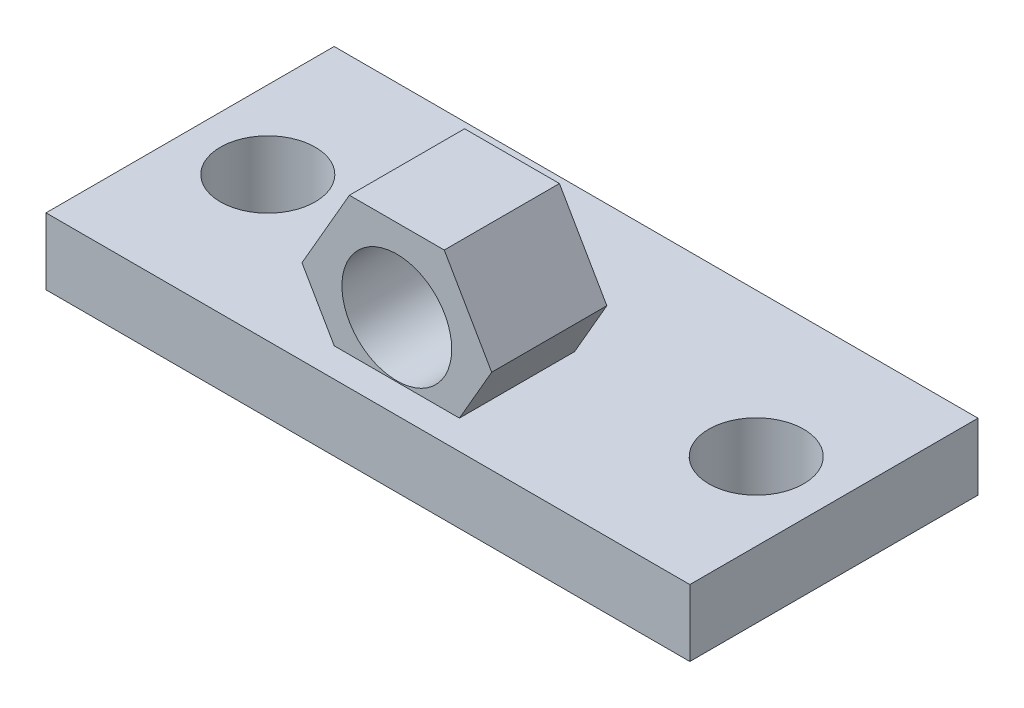
ISO-10303-21;
HEADER;
FILE_DESCRIPTION(('STEP AP214'),'2;1');
FILE_NAME('part.step','',(''),(''),'','','');
FILE_SCHEMA(('AUTOMOTIVE_DESIGN { 1 0 10303 214 1 1 1 1 }'));
ENDSEC;
DATA;
#1=APPLICATION_CONTEXT('core data for automotive mechanical design processes');
#2=APPLICATION_PROTOCOL_DEFINITION('international standard','automotive_design',2000,#1);
#3=PRODUCT_CONTEXT('',#1,'mechanical');
#4=PRODUCT('Part','Part','',(#3));
#5=PRODUCT_RELATED_PRODUCT_CATEGORY('part','',(#4));
#6=PRODUCT_DEFINITION_FORMATION('','',#4);
#7=PRODUCT_DEFINITION_CONTEXT('part definition',#1,'design');
#8=PRODUCT_DEFINITION('design','',#6,#7);
#9=PRODUCT_DEFINITION_SHAPE('','',#8);
#10=(LENGTH_UNIT() NAMED_UNIT(*) SI_UNIT(.MILLI.,.METRE.));
#11=(NAMED_UNIT(*) PLANE_ANGLE_UNIT() SI_UNIT($,.RADIAN.));
#12=(NAMED_UNIT(*) SI_UNIT($,.STERADIAN.) SOLID_ANGLE_UNIT());
#13=UNCERTAINTY_MEASURE_WITH_UNIT(LENGTH_MEASURE(1.E-05),#10,'distance_accuracy_value','');
#14=(GEOMETRIC_REPRESENTATION_CONTEXT(3) GLOBAL_UNCERTAINTY_ASSIGNED_CONTEXT((#13)) GLOBAL_UNIT_ASSIGNED_CONTEXT((#10,
#11,#12)) REPRESENTATION_CONTEXT('',''));
#15=CARTESIAN_POINT('',(0.,0.,0.));
#16=DIRECTION('',(0.,0.,1.));
#17=DIRECTION('',(1.,0.,0.));
#18=AXIS2_PLACEMENT_3D('',#15,#16,#17);
#19=CARTESIAN_POINT('',(0.,5.,0.));
#20=DIRECTION('',(0.,1.,0.));
#21=DIRECTION('',(0.,0.,1.));
#22=AXIS2_PLACEMENT_3D('',#19,#20,#21);
#23=PLANE('',#22);
#24=DIRECTION('',(0.,0.,-1.));
#25=VECTOR('',#24,1.);
#26=CARTESIAN_POINT('',(24.1402131088825,5.,-10.804011461318));
#27=LINE('',#26,#25);
#28=CARTESIAN_POINT('',(24.1402131088825,5.,10.804011461318));
#29=VERTEX_POINT('',#28);
#30=CARTESIAN_POINT('',(24.1402131088825,5.,-10.804011461318));
#31=VERTEX_POINT('',#30);
#32=EDGE_CURVE('E160',#29,#31,#27,.T.);
#33=ORIENTED_EDGE('',*,*,#32,.T.);
#34=DIRECTION('',(-1.,0.,0.));
#35=VECTOR('',#34,1.);
#36=CARTESIAN_POINT('',(-24.1402131088825,5.,-10.804011461318));
#37=LINE('',#36,#35);
#38=CARTESIAN_POINT('',(-24.1402131088825,5.,-10.804011461318));
#39=VERTEX_POINT('',#38);
#40=EDGE_CURVE('E86',#31,#39,#37,.T.);
#41=ORIENTED_EDGE('',*,*,#40,.T.);
#42=DIRECTION('',(0.,0.,1.));
#43=VECTOR('',#42,1.);
#44=CARTESIAN_POINT('',(-24.1402131088825,5.,-10.804011461318));
#45=LINE('',#44,#43);
#46=CARTESIAN_POINT('',(-24.1402131088825,5.,10.804011461318));
#47=VERTEX_POINT('',#46);
#48=EDGE_CURVE('E163',#39,#47,#45,.T.);
#49=ORIENTED_EDGE('',*,*,#48,.T.);
#50=DIRECTION('',(1.,0.,0.));
#51=VECTOR('',#50,1.);
#52=CARTESIAN_POINT('',(-24.1402131088825,5.,10.804011461318));
#53=LINE('',#52,#51);
#54=EDGE_CURVE('E57',#47,#29,#53,.T.);
#55=ORIENTED_EDGE('',*,*,#54,.T.);
#56=EDGE_LOOP('',(#33,#41,#49,#55));
#57=FACE_BOUND('',#56,.T.);
#58=CARTESIAN_POINT('',(18.3128397154953,5.,0.));
#59=DIRECTION('',(0.,1.,0.));
#60=DIRECTION('',(0.,0.,1.));
#61=AXIS2_PLACEMENT_3D('',#58,#59,#60);
#62=CIRCLE('',#61,3.556);
#63=CARTESIAN_POINT('',(18.3128397154953,5.,3.556));
#64=VERTEX_POINT('',#63);
#65=EDGE_CURVE('E156',#64,#64,#62,.T.);
#66=ORIENTED_EDGE('',*,*,#65,.F.);
#67=EDGE_LOOP('',(#66));
#68=FACE_BOUND('',#67,.T.);
#69=CARTESIAN_POINT('',(-18.3128397154953,5.,0.));
#70=DIRECTION('',(0.,1.,0.));
#71=DIRECTION('',(0.,0.,1.));
#72=AXIS2_PLACEMENT_3D('',#69,#70,#71);
#73=CIRCLE('',#72,3.556);
#74=CARTESIAN_POINT('',(-18.3128397154953,5.,3.556));
#75=VERTEX_POINT('',#74);
#76=EDGE_CURVE('E147',#75,#75,#73,.T.);
#77=ORIENTED_EDGE('',*,*,#76,.F.);
#78=EDGE_LOOP('',(#77));
#79=FACE_BOUND('',#78,.T.);
#80=DIRECTION('',(1.,0.,0.));
#81=VECTOR('',#80,1.);
#82=CARTESIAN_POINT('',(0.,5.,0.));
#83=LINE('',#82,#81);
#84=CARTESIAN_POINT('',(-4.69311753214681,5.,0.));
#85=VERTEX_POINT('',#84);
#86=CARTESIAN_POINT('',(4.69311753214686,5.,0.));
#87=VERTEX_POINT('',#86);
#88=EDGE_CURVE('E187',#85,#87,#83,.T.);
#89=ORIENTED_EDGE('',*,*,#88,.T.);
#90=DIRECTION('',(0.,0.,1.));
#91=VECTOR('',#90,1.);
#92=CARTESIAN_POINT('',(4.69311753214686,5.,0.));
#93=LINE('',#92,#91);
#94=CARTESIAN_POINT('',(4.69311753214686,5.,8.63600000000001));
#95=VERTEX_POINT('',#94);
#96=EDGE_CURVE('E11',#87,#95,#93,.T.);
#97=ORIENTED_EDGE('',*,*,#96,.T.);
#98=DIRECTION('',(1.,0.,0.));
#99=VECTOR('',#98,1.);
#100=CARTESIAN_POINT('',(0.,5.,8.63600000000001));
#101=LINE('',#100,#99);
#102=CARTESIAN_POINT('',(-4.69311753214681,5.,8.63600000000001));
#103=VERTEX_POINT('',#102);
#104=EDGE_CURVE('E41',#103,#95,#101,.T.);
#105=ORIENTED_EDGE('',*,*,#104,.F.);
#106=DIRECTION('',(0.,0.,-1.));
#107=VECTOR('',#106,1.);
#108=CARTESIAN_POINT('',(-4.69311753214681,5.,0.));
#109=LINE('',#108,#107);
#110=EDGE_CURVE('E182',#103,#85,#109,.T.);
#111=ORIENTED_EDGE('',*,*,#110,.T.);
#112=EDGE_LOOP('',(#89,#97,#105,#111));
#113=FACE_BOUND('',#112,.T.);
#114=ADVANCED_FACE('F33',(#57,#68,#79,#113),#23,.T.);
#115=CARTESIAN_POINT('',(0.,0.,0.));
#116=DIRECTION('',(0.,1.,0.));
#117=DIRECTION('',(0.,0.,1.));
#118=AXIS2_PLACEMENT_3D('',#115,#116,#117);
#119=PLANE('',#118);
#120=CARTESIAN_POINT('',(-18.3128397154953,0.,0.));
#121=DIRECTION('',(0.,1.,0.));
#122=DIRECTION('',(0.,0.,1.));
#123=AXIS2_PLACEMENT_3D('',#120,#121,#122);
#124=CIRCLE('',#123,3.556);
#125=CARTESIAN_POINT('',(-18.3128397154953,0.,3.556));
#126=VERTEX_POINT('',#125);
#127=EDGE_CURVE('E144',#126,#126,#124,.T.);
#128=ORIENTED_EDGE('',*,*,#127,.T.);
#129=EDGE_LOOP('',(#128));
#130=FACE_BOUND('',#129,.T.);
#131=CARTESIAN_POINT('',(18.3128397154953,0.,0.));
#132=DIRECTION('',(0.,1.,0.));
#133=DIRECTION('',(0.,0.,1.));
#134=AXIS2_PLACEMENT_3D('',#131,#132,#133);
#135=CIRCLE('',#134,3.556);
#136=CARTESIAN_POINT('',(18.3128397154953,0.,3.556));
#137=VERTEX_POINT('',#136);
#138=EDGE_CURVE('E155',#137,#137,#135,.T.);
#139=ORIENTED_EDGE('',*,*,#138,.T.);
#140=EDGE_LOOP('',(#139));
#141=FACE_BOUND('',#140,.T.);
#142=DIRECTION('',(0.,0.,-1.));
#143=VECTOR('',#142,1.);
#144=CARTESIAN_POINT('',(24.1402131088825,0.,-10.804011461318));
#145=LINE('',#144,#143);
#146=CARTESIAN_POINT('',(24.1402131088825,0.,10.804011461318));
#147=VERTEX_POINT('',#146);
#148=CARTESIAN_POINT('',(24.1402131088825,0.,-10.804011461318));
#149=VERTEX_POINT('',#148);
#150=EDGE_CURVE('E159',#147,#149,#145,.T.);
#151=ORIENTED_EDGE('',*,*,#150,.F.);
#152=DIRECTION('',(1.,0.,0.));
#153=VECTOR('',#152,1.);
#154=CARTESIAN_POINT('',(-24.1402131088825,0.,10.804011461318));
#155=LINE('',#154,#153);
#156=CARTESIAN_POINT('',(-24.1402131088825,0.,10.804011461318));
#157=VERTEX_POINT('',#156);
#158=EDGE_CURVE('E78',#157,#147,#155,.T.);
#159=ORIENTED_EDGE('',*,*,#158,.F.);
#160=DIRECTION('',(0.,0.,1.));
#161=VECTOR('',#160,1.);
#162=CARTESIAN_POINT('',(-24.1402131088825,0.,-10.804011461318));
#163=LINE('',#162,#161);
#164=CARTESIAN_POINT('',(-24.1402131088825,0.,-10.804011461318));
#165=VERTEX_POINT('',#164);
#166=EDGE_CURVE('E171',#165,#157,#163,.T.);
#167=ORIENTED_EDGE('',*,*,#166,.F.);
#168=DIRECTION('',(-1.,0.,0.));
#169=VECTOR('',#168,1.);
#170=CARTESIAN_POINT('',(-24.1402131088825,0.,-10.804011461318));
#171=LINE('',#170,#169);
#172=EDGE_CURVE('E169',#149,#165,#171,.T.);
#173=ORIENTED_EDGE('',*,*,#172,.F.);
#174=EDGE_LOOP('',(#151,#159,#167,#173));
#175=FACE_BOUND('',#174,.T.);
#176=ADVANCED_FACE('F237',(#130,#141,#175),#119,.F.);
#177=CARTESIAN_POINT('',(24.1402131088825,5.,-10.804011461318));
#178=DIRECTION('',(-1.,0.,0.));
#179=DIRECTION('',(0.,0.,1.));
#180=AXIS2_PLACEMENT_3D('',#177,#178,#179);
#181=PLANE('',#180);
#182=ORIENTED_EDGE('',*,*,#150,.T.);
#183=DIRECTION('',(0.,-1.,0.));
#184=VECTOR('',#183,1.);
#185=CARTESIAN_POINT('',(24.1402131088825,5.,-10.804011461318));
#186=LINE('',#185,#184);
#187=EDGE_CURVE('E180',#31,#149,#186,.T.);
#188=ORIENTED_EDGE('',*,*,#187,.F.);
#189=ORIENTED_EDGE('',*,*,#32,.F.);
#190=DIRECTION('',(0.,-1.,0.));
#191=VECTOR('',#190,1.);
#192=CARTESIAN_POINT('',(24.1402131088825,5.,10.804011461318));
#193=LINE('',#192,#191);
#194=EDGE_CURVE('E166',#29,#147,#193,.T.);
#195=ORIENTED_EDGE('',*,*,#194,.T.);
#196=EDGE_LOOP('',(#182,#188,#189,#195));
#197=FACE_BOUND('',#196,.T.);
#198=ADVANCED_FACE('F35',(#197),#181,.F.);
#199=CARTESIAN_POINT('',(-24.1402131088825,5.,-10.804011461318));
#200=DIRECTION('',(0.,0.,1.));
#201=DIRECTION('',(1.,0.,0.));
#202=AXIS2_PLACEMENT_3D('',#199,#200,#201);
#203=PLANE('',#202);
#204=ORIENTED_EDGE('',*,*,#172,.T.);
#205=DIRECTION('',(0.,-1.,0.));
#206=VECTOR('',#205,1.);
#207=CARTESIAN_POINT('',(-24.1402131088825,5.,-10.804011461318));
#208=LINE('',#207,#206);
#209=EDGE_CURVE('E177',#39,#165,#208,.T.);
#210=ORIENTED_EDGE('',*,*,#209,.F.);
#211=ORIENTED_EDGE('',*,*,#40,.F.);
#212=ORIENTED_EDGE('',*,*,#187,.T.);
#213=EDGE_LOOP('',(#204,#210,#211,#212));
#214=FACE_BOUND('',#213,.T.);
#215=ADVANCED_FACE('F254',(#214),#203,.F.);
#216=CARTESIAN_POINT('',(-24.1402131088825,5.,-10.804011461318));
#217=DIRECTION('',(1.,0.,0.));
#218=DIRECTION('',(0.,0.,-1.));
#219=AXIS2_PLACEMENT_3D('',#216,#217,#218);
#220=PLANE('',#219);
#221=ORIENTED_EDGE('',*,*,#166,.T.);
#222=DIRECTION('',(0.,-1.,0.));
#223=VECTOR('',#222,1.);
#224=CARTESIAN_POINT('',(-24.1402131088825,5.,10.804011461318));
#225=LINE('',#224,#223);
#226=EDGE_CURVE('E175',#47,#157,#225,.T.);
#227=ORIENTED_EDGE('',*,*,#226,.F.);
#228=ORIENTED_EDGE('',*,*,#48,.F.);
#229=ORIENTED_EDGE('',*,*,#209,.T.);
#230=EDGE_LOOP('',(#221,#227,#228,#229));
#231=FACE_BOUND('',#230,.T.);
#232=ADVANCED_FACE('F252',(#231),#220,.F.);
#233=CARTESIAN_POINT('',(-24.1402131088825,5.,10.804011461318));
#234=DIRECTION('',(0.,0.,-1.));
#235=DIRECTION('',(-1.,0.,0.));
#236=AXIS2_PLACEMENT_3D('',#233,#234,#235);
#237=PLANE('',#236);
#238=ORIENTED_EDGE('',*,*,#158,.T.);
#239=ORIENTED_EDGE('',*,*,#194,.F.);
#240=ORIENTED_EDGE('',*,*,#54,.F.);
#241=ORIENTED_EDGE('',*,*,#226,.T.);
#242=EDGE_LOOP('',(#238,#239,#240,#241));
#243=FACE_BOUND('',#242,.T.);
#244=ADVANCED_FACE('F249',(#243),#237,.F.);
#245=CARTESIAN_POINT('',(18.3128397154953,-20.828,0.));
#246=DIRECTION('',(0.,1.,0.));
#247=DIRECTION('',(0.,0.,1.));
#248=AXIS2_PLACEMENT_3D('',#245,#246,#247);
#249=CYLINDRICAL_SURFACE('',#248,3.556);
#250=ORIENTED_EDGE('',*,*,#65,.T.);
#251=EDGE_LOOP('',(#250));
#252=FACE_BOUND('',#251,.T.);
#253=ORIENTED_EDGE('',*,*,#138,.F.);
#254=EDGE_LOOP('',(#253));
#255=FACE_BOUND('',#254,.T.);
#256=ADVANCED_FACE('F246',(#252,#255),#249,.F.);
#257=CARTESIAN_POINT('',(-18.3128397154953,-15.828,0.));
#258=DIRECTION('',(0.,1.,0.));
#259=DIRECTION('',(0.,0.,1.));
#260=AXIS2_PLACEMENT_3D('',#257,#258,#259);
#261=CYLINDRICAL_SURFACE('',#260,3.556);
#262=ORIENTED_EDGE('',*,*,#76,.T.);
#263=EDGE_LOOP('',(#262));
#264=FACE_BOUND('',#263,.T.);
#265=ORIENTED_EDGE('',*,*,#127,.F.);
#266=EDGE_LOOP('',(#265));
#267=FACE_BOUND('',#266,.T.);
#268=ADVANCED_FACE('F285',(#264,#267),#261,.F.);
#269=CARTESIAN_POINT('',(0.,0.,8.63600000000001));
#270=DIRECTION('',(0.,0.,1.));
#271=DIRECTION('',(1.,0.,0.));
#272=AXIS2_PLACEMENT_3D('',#269,#270,#271);
#273=PLANE('',#272);
#274=DIRECTION('',(0.500000000000007,-0.866025403784434,0.));
#275=VECTOR('',#274,1.);
#276=CARTESIAN_POINT('',(-7.11225164171783,9.19006318809983,8.63600000000001));
#277=LINE('',#276,#275);
#278=CARTESIAN_POINT('',(-7.11225164171783,9.19006318809983,8.63600000000001));
#279=VERTEX_POINT('',#278);
#280=EDGE_CURVE('E204',#279,#103,#277,.T.);
#281=ORIENTED_EDGE('',*,*,#280,.T.);
#282=ORIENTED_EDGE('',*,*,#104,.T.);
#283=DIRECTION('',(0.499999999999995,0.866025403784441,0.));
#284=VECTOR('',#283,1.);
#285=CARTESIAN_POINT('',(3.55612582085899,3.0306725882647,8.63600000000001));
#286=LINE('',#285,#284);
#287=CARTESIAN_POINT('',(7.11225164171783,9.19006318809988,8.63600000000001));
#288=VERTEX_POINT('',#287);
#289=EDGE_CURVE('E120',#95,#288,#286,.T.);
#290=ORIENTED_EDGE('',*,*,#289,.T.);
#291=DIRECTION('',(-0.500000000000001,0.866025403784438,0.));
#292=VECTOR('',#291,1.);
#293=CARTESIAN_POINT('',(7.11225164171783,9.19006318809988,8.63600000000001));
#294=LINE('',#293,#292);
#295=CARTESIAN_POINT('',(3.5561258208589,15.3494537879351,8.63600000000001));
#296=VERTEX_POINT('',#295);
#297=EDGE_CURVE('E125',#288,#296,#294,.T.);
#298=ORIENTED_EDGE('',*,*,#297,.T.);
#299=DIRECTION('',(-1.,0.,0.));
#300=VECTOR('',#299,1.);
#301=CARTESIAN_POINT('',(3.5561258208589,15.3494537879351,8.63600000000001));
#302=LINE('',#301,#300);
#303=CARTESIAN_POINT('',(-3.55612582085894,15.3494537879351,8.63600000000001));
#304=VERTEX_POINT('',#303);
#305=EDGE_CURVE('E138',#296,#304,#302,.T.);
#306=ORIENTED_EDGE('',*,*,#305,.T.);
#307=DIRECTION('',(-0.499999999999995,-0.866025403784441,0.));
#308=VECTOR('',#307,1.);
#309=CARTESIAN_POINT('',(-3.55612582085894,15.3494537879351,8.63600000000001));
#310=LINE('',#309,#308);
#311=EDGE_CURVE('E218',#304,#279,#310,.T.);
#312=ORIENTED_EDGE('',*,*,#311,.T.);
#313=EDGE_LOOP('',(#281,#282,#290,#298,#306,#312));
#314=FACE_BOUND('',#313,.T.);
#315=CARTESIAN_POINT('',(0.,9.19006318809988,8.63600000000001));
#316=DIRECTION('',(0.,0.,1.));
#317=DIRECTION('',(1.,0.,0.));
#318=AXIS2_PLACEMENT_3D('',#315,#316,#317);
#319=CIRCLE('',#318,4.11729013504681);
#320=CARTESIAN_POINT('',(4.11729013504681,9.19006318809988,8.63600000000001));
#321=VERTEX_POINT('',#320);
#322=EDGE_CURVE('E196',#321,#321,#319,.T.);
#323=ORIENTED_EDGE('',*,*,#322,.F.);
#324=EDGE_LOOP('',(#323));
#325=FACE_BOUND('',#324,.T.);
#326=ADVANCED_FACE('F123',(#314,#325),#273,.T.);
#327=CARTESIAN_POINT('',(0.,0.,0.));
#328=DIRECTION('',(0.,0.,1.));
#329=DIRECTION('',(1.,0.,0.));
#330=AXIS2_PLACEMENT_3D('',#327,#328,#329);
#331=PLANE('',#330);
#332=ORIENTED_EDGE('',*,*,#88,.F.);
#333=DIRECTION('',(0.500000000000007,-0.866025403784434,0.));
#334=VECTOR('',#333,1.);
#335=CARTESIAN_POINT('',(-7.11225164171783,9.19006318809983,0.));
#336=LINE('',#335,#334);
#337=CARTESIAN_POINT('',(-7.11225164171783,9.19006318809983,0.));
#338=VERTEX_POINT('',#337);
#339=EDGE_CURVE('E48',#338,#85,#336,.T.);
#340=ORIENTED_EDGE('',*,*,#339,.F.);
#341=DIRECTION('',(-0.499999999999995,-0.866025403784441,0.));
#342=VECTOR('',#341,1.);
#343=CARTESIAN_POINT('',(-3.55612582085894,15.3494537879351,0.));
#344=LINE('',#343,#342);
#345=CARTESIAN_POINT('',(-3.55612582085894,15.3494537879351,0.));
#346=VERTEX_POINT('',#345);
#347=EDGE_CURVE('E208',#346,#338,#344,.T.);
#348=ORIENTED_EDGE('',*,*,#347,.F.);
#349=DIRECTION('',(-1.,0.,0.));
#350=VECTOR('',#349,1.);
#351=CARTESIAN_POINT('',(3.5561258208589,15.3494537879351,0.));
#352=LINE('',#351,#350);
#353=CARTESIAN_POINT('',(3.5561258208589,15.3494537879351,0.));
#354=VERTEX_POINT('',#353);
#355=EDGE_CURVE('E198',#354,#346,#352,.T.);
#356=ORIENTED_EDGE('',*,*,#355,.F.);
#357=DIRECTION('',(-0.500000000000001,0.866025403784438,0.));
#358=VECTOR('',#357,1.);
#359=CARTESIAN_POINT('',(7.11225164171783,9.19006318809988,0.));
#360=LINE('',#359,#358);
#361=CARTESIAN_POINT('',(7.11225164171783,9.19006318809988,0.));
#362=VERTEX_POINT('',#361);
#363=EDGE_CURVE('E195',#362,#354,#360,.T.);
#364=ORIENTED_EDGE('',*,*,#363,.F.);
#365=DIRECTION('',(0.499999999999995,0.866025403784441,0.));
#366=VECTOR('',#365,1.);
#367=CARTESIAN_POINT('',(3.55612582085899,3.0306725882647,0.));
#368=LINE('',#367,#366);
#369=EDGE_CURVE('E142',#87,#362,#368,.T.);
#370=ORIENTED_EDGE('',*,*,#369,.F.);
#371=EDGE_LOOP('',(#332,#340,#348,#356,#364,#370));
#372=FACE_BOUND('',#371,.T.);
#373=CARTESIAN_POINT('',(0.,9.19006318809988,0.));
#374=DIRECTION('',(0.,0.,1.));
#375=DIRECTION('',(1.,0.,0.));
#376=AXIS2_PLACEMENT_3D('',#373,#374,#375);
#377=CIRCLE('',#376,4.11729013504681);
#378=CARTESIAN_POINT('',(4.11729013504681,9.19006318809988,0.));
#379=VERTEX_POINT('',#378);
#380=EDGE_CURVE('E201',#379,#379,#377,.T.);
#381=ORIENTED_EDGE('',*,*,#380,.T.);
#382=EDGE_LOOP('',(#381));
#383=FACE_BOUND('',#382,.T.);
#384=ADVANCED_FACE('F191',(#372,#383),#331,.F.);
#385=CARTESIAN_POINT('',(3.55612582085899,3.0306725882647,8.63600000000001));
#386=DIRECTION('',(-0.866025403784441,0.499999999999995,0.));
#387=DIRECTION('',(-0.499999999999995,-0.866025403784442,0.));
#388=AXIS2_PLACEMENT_3D('',#385,#386,#387);
#389=PLANE('',#388);
#390=ORIENTED_EDGE('',*,*,#96,.F.);
#391=ORIENTED_EDGE('',*,*,#369,.T.);
#392=DIRECTION('',(0.,0.,-1.));
#393=VECTOR('',#392,1.);
#394=CARTESIAN_POINT('',(7.11225164171783,9.19006318809988,8.63600000000001));
#395=LINE('',#394,#393);
#396=EDGE_CURVE('E134',#288,#362,#395,.T.);
#397=ORIENTED_EDGE('',*,*,#396,.F.);
#398=ORIENTED_EDGE('',*,*,#289,.F.);
#399=EDGE_LOOP('',(#390,#391,#397,#398));
#400=FACE_BOUND('',#399,.T.);
#401=ADVANCED_FACE('F140',(#400),#389,.F.);
#402=CARTESIAN_POINT('',(7.11225164171783,9.19006318809988,8.63600000000001));
#403=DIRECTION('',(-0.866025403784438,-0.500000000000001,0.));
#404=DIRECTION('',(0.500000000000001,-0.866025403784438,0.));
#405=AXIS2_PLACEMENT_3D('',#402,#403,#404);
#406=PLANE('',#405);
#407=ORIENTED_EDGE('',*,*,#363,.T.);
#408=DIRECTION('',(0.,0.,-1.));
#409=VECTOR('',#408,1.);
#410=CARTESIAN_POINT('',(3.5561258208589,15.3494537879351,8.63600000000001));
#411=LINE('',#410,#409);
#412=EDGE_CURVE('E136',#296,#354,#411,.T.);
#413=ORIENTED_EDGE('',*,*,#412,.F.);
#414=ORIENTED_EDGE('',*,*,#297,.F.);
#415=ORIENTED_EDGE('',*,*,#396,.T.);
#416=EDGE_LOOP('',(#407,#413,#414,#415));
#417=FACE_BOUND('',#416,.T.);
#418=ADVANCED_FACE('F133',(#417),#406,.F.);
#419=CARTESIAN_POINT('',(3.5561258208589,15.3494537879351,8.63600000000001));
#420=DIRECTION('',(0.,-1.,0.));
#421=DIRECTION('',(1.,0.,0.));
#422=AXIS2_PLACEMENT_3D('',#419,#420,#421);
#423=PLANE('',#422);
#424=ORIENTED_EDGE('',*,*,#355,.T.);
#425=DIRECTION('',(0.,0.,-1.));
#426=VECTOR('',#425,1.);
#427=CARTESIAN_POINT('',(-3.55612582085894,15.3494537879351,8.63600000000001));
#428=LINE('',#427,#426);
#429=EDGE_CURVE('E149',#304,#346,#428,.T.);
#430=ORIENTED_EDGE('',*,*,#429,.F.);
#431=ORIENTED_EDGE('',*,*,#305,.F.);
#432=ORIENTED_EDGE('',*,*,#412,.T.);
#433=EDGE_LOOP('',(#424,#430,#431,#432));
#434=FACE_BOUND('',#433,.T.);
#435=ADVANCED_FACE('F220',(#434),#423,.F.);
#436=CARTESIAN_POINT('',(-3.55612582085894,15.3494537879351,8.63600000000001));
#437=DIRECTION('',(0.866025403784442,-0.499999999999995,0.));
#438=DIRECTION('',(0.499999999999995,0.866025403784442,0.));
#439=AXIS2_PLACEMENT_3D('',#436,#437,#438);
#440=PLANE('',#439);
#441=ORIENTED_EDGE('',*,*,#347,.T.);
#442=DIRECTION('',(0.,0.,-1.));
#443=VECTOR('',#442,1.);
#444=CARTESIAN_POINT('',(-7.11225164171783,9.19006318809983,8.63600000000001));
#445=LINE('',#444,#443);
#446=EDGE_CURVE('E211',#279,#338,#445,.T.);
#447=ORIENTED_EDGE('',*,*,#446,.F.);
#448=ORIENTED_EDGE('',*,*,#311,.F.);
#449=ORIENTED_EDGE('',*,*,#429,.T.);
#450=EDGE_LOOP('',(#441,#447,#448,#449));
#451=FACE_BOUND('',#450,.T.);
#452=ADVANCED_FACE('F216',(#451),#440,.F.);
#453=CARTESIAN_POINT('',(-7.11225164171783,9.19006318809983,8.63600000000001));
#454=DIRECTION('',(0.866025403784434,0.500000000000007,0.));
#455=DIRECTION('',(-0.500000000000007,0.866025403784435,0.));
#456=AXIS2_PLACEMENT_3D('',#453,#454,#455);
#457=PLANE('',#456);
#458=ORIENTED_EDGE('',*,*,#110,.F.);
#459=ORIENTED_EDGE('',*,*,#280,.F.);
#460=ORIENTED_EDGE('',*,*,#446,.T.);
#461=ORIENTED_EDGE('',*,*,#339,.T.);
#462=EDGE_LOOP('',(#458,#459,#460,#461));
#463=FACE_BOUND('',#462,.T.);
#464=ADVANCED_FACE('F228',(#463),#457,.F.);
#465=CARTESIAN_POINT('',(0.,9.19006318809988,8.63600000000001));
#466=DIRECTION('',(0.,0.,-1.));
#467=DIRECTION('',(-1.,0.,0.));
#468=AXIS2_PLACEMENT_3D('',#465,#466,#467);
#469=CYLINDRICAL_SURFACE('',#468,4.11729013504681);
#470=ORIENTED_EDGE('',*,*,#322,.T.);
#471=EDGE_LOOP('',(#470));
#472=FACE_BOUND('',#471,.T.);
#473=ORIENTED_EDGE('',*,*,#380,.F.);
#474=EDGE_LOOP('',(#473));
#475=FACE_BOUND('',#474,.T.);
#476=ADVANCED_FACE('F226',(#472,#475),#469,.F.);
#477=CLOSED_SHELL('',(#114,#176,#198,#215,#232,#244,#256,#268,#326,#384,#401,#418,#435,#452,
#464,#476));
#478=MANIFOLD_SOLID_BREP('B2',#477);
#479=ADVANCED_BREP_SHAPE_REPRESENTATION('',(#18,#478),#14);
#480=SHAPE_DEFINITION_REPRESENTATION(#9,#479);
ENDSEC;
END-ISO-10303-21;
